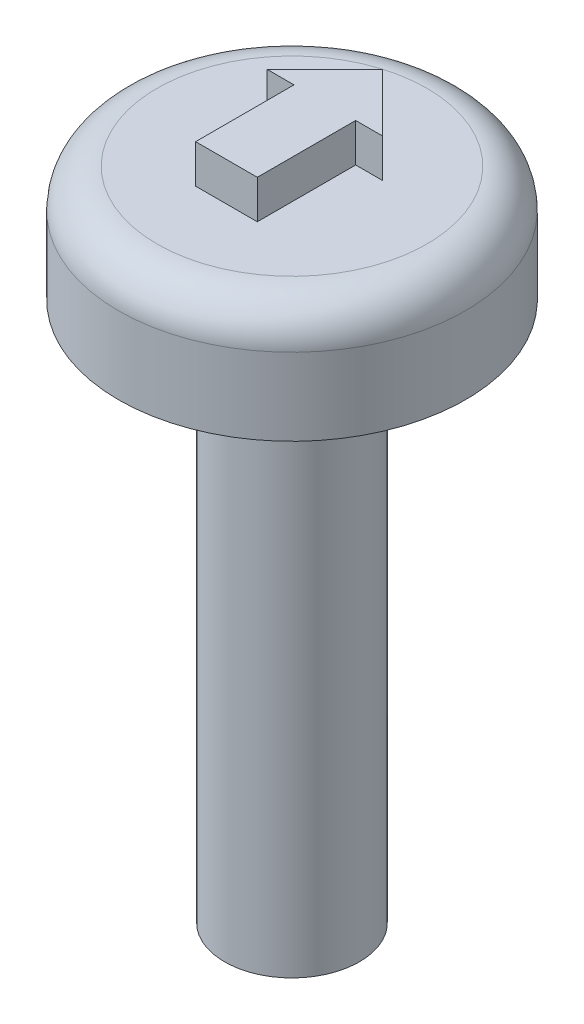
ISO-10303-21;
HEADER;
FILE_DESCRIPTION(('STEP AP214'),'2;1');
FILE_NAME('part.step','',(''),(''),'','','');
FILE_SCHEMA(('AUTOMOTIVE_DESIGN { 1 0 10303 214 1 1 1 1 }'));
ENDSEC;
DATA;
#1=APPLICATION_CONTEXT('core data for automotive mechanical design processes');
#2=APPLICATION_PROTOCOL_DEFINITION('international standard','automotive_design',2000,#1);
#3=PRODUCT_CONTEXT('',#1,'mechanical');
#4=PRODUCT('Part','Part','',(#3));
#5=PRODUCT_RELATED_PRODUCT_CATEGORY('part','',(#4));
#6=PRODUCT_DEFINITION_FORMATION('','',#4);
#7=PRODUCT_DEFINITION_CONTEXT('part definition',#1,'design');
#8=PRODUCT_DEFINITION('design','',#6,#7);
#9=PRODUCT_DEFINITION_SHAPE('','',#8);
#10=(LENGTH_UNIT() NAMED_UNIT(*) SI_UNIT(.MILLI.,.METRE.));
#11=(NAMED_UNIT(*) PLANE_ANGLE_UNIT() SI_UNIT($,.RADIAN.));
#12=(NAMED_UNIT(*) SI_UNIT($,.STERADIAN.) SOLID_ANGLE_UNIT());
#13=UNCERTAINTY_MEASURE_WITH_UNIT(LENGTH_MEASURE(1.E-05),#10,'distance_accuracy_value','');
#14=(GEOMETRIC_REPRESENTATION_CONTEXT(3) GLOBAL_UNCERTAINTY_ASSIGNED_CONTEXT((#13)) GLOBAL_UNIT_ASSIGNED_CONTEXT((#10,
#11,#12)) REPRESENTATION_CONTEXT('',''));
#15=CARTESIAN_POINT('',(0.,0.,0.));
#16=DIRECTION('',(0.,0.,1.));
#17=DIRECTION('',(1.,0.,0.));
#18=AXIS2_PLACEMENT_3D('',#15,#16,#17);
#19=CARTESIAN_POINT('',(40.910304770079,118.601538020996,143.155146091223));
#20=DIRECTION('',(0.,0.999999999999999,-4.37113995792923E-08));
#21=DIRECTION('',(0.,4.37113995792923E-08,0.999999999999999));
#22=AXIS2_PLACEMENT_3D('',#19,#20,#21);
#23=PLANE('',#22);
#24=CARTESIAN_POINT('',(40.910304770079,118.601538020996,143.155146091223));
#25=DIRECTION('',(0.,0.999999999999999,-4.37113995792923E-08));
#26=DIRECTION('',(0.,4.37113995792923E-08,0.999999999999999));
#27=AXIS2_PLACEMENT_3D('',#24,#25,#26);
#28=CIRCLE('',#27,3.50000000000005);
#29=CARTESIAN_POINT('',(40.910304770079,118.601538173986,146.655146091223));
#30=VERTEX_POINT('',#29);
#31=EDGE_CURVE('E153',#30,#30,#28,.T.);
#32=ORIENTED_EDGE('',*,*,#31,.T.);
#33=EDGE_LOOP('',(#32));
#34=FACE_BOUND('',#33,.T.);
#35=DIRECTION('',(0.,4.37113956441098E-08,0.999999999999999));
#36=VECTOR('',#35,1.);
#37=CARTESIAN_POINT('',(40.110304770079,118.60153798376,142.303283684095));
#38=LINE('',#37,#36);
#39=CARTESIAN_POINT('',(40.110304770079,118.60153798376,142.303283684095));
#40=VERTEX_POINT('',#39);
#41=CARTESIAN_POINT('',(40.110304770079,118.601538095305,144.855146091223));
#42=VERTEX_POINT('',#41);
#43=EDGE_CURVE('E128',#40,#42,#38,.T.);
#44=ORIENTED_EDGE('',*,*,#43,.F.);
#45=DIRECTION('',(1.,0.,0.));
#46=VECTOR('',#45,1.);
#47=CARTESIAN_POINT('',(39.410304770079,118.60153798376,142.303283684095));
#48=LINE('',#47,#46);
#49=CARTESIAN_POINT('',(39.410304770079,118.60153798376,142.303283684095));
#50=VERTEX_POINT('',#49);
#51=EDGE_CURVE('E125',#50,#40,#48,.T.);
#52=ORIENTED_EDGE('',*,*,#51,.F.);
#53=DIRECTION('',(-0.707106781186547,3.09086242539357E-08,0.707106781186547));
#54=VECTOR('',#53,1.);
#55=CARTESIAN_POINT('',(40.910304770079,118.601537918193,140.803283684095));
#56=LINE('',#55,#54);
#57=CARTESIAN_POINT('',(40.910304770079,118.601537918193,140.803283684095));
#58=VERTEX_POINT('',#57);
#59=EDGE_CURVE('E81',#58,#50,#56,.T.);
#60=ORIENTED_EDGE('',*,*,#59,.F.);
#61=DIRECTION('',(-0.707106781186546,-3.09086307959877E-08,-0.707106781186549));
#62=VECTOR('',#61,1.);
#63=CARTESIAN_POINT('',(42.410304770079,118.60153798376,142.303283684095));
#64=LINE('',#63,#62);
#65=CARTESIAN_POINT('',(42.410304770079,118.60153798376,142.303283684095));
#66=VERTEX_POINT('',#65);
#67=EDGE_CURVE('E136',#66,#58,#64,.T.);
#68=ORIENTED_EDGE('',*,*,#67,.F.);
#69=DIRECTION('',(1.,0.,0.));
#70=VECTOR('',#69,1.);
#71=CARTESIAN_POINT('',(41.710304770079,118.60153798376,142.303283684095));
#72=LINE('',#71,#70);
#73=CARTESIAN_POINT('',(41.710304770079,118.60153798376,142.303283684095));
#74=VERTEX_POINT('',#73);
#75=EDGE_CURVE('E114',#74,#66,#72,.T.);
#76=ORIENTED_EDGE('',*,*,#75,.F.);
#77=DIRECTION('',(0.,-4.37114010824076E-08,-0.999999999999999));
#78=VECTOR('',#77,1.);
#79=CARTESIAN_POINT('',(41.710304770079,118.601538095305,144.855146091223));
#80=LINE('',#79,#78);
#81=CARTESIAN_POINT('',(41.710304770079,118.601538095305,144.855146091223));
#82=VERTEX_POINT('',#81);
#83=EDGE_CURVE('E133',#82,#74,#80,.T.);
#84=ORIENTED_EDGE('',*,*,#83,.F.);
#85=DIRECTION('',(1.,0.,0.));
#86=VECTOR('',#85,1.);
#87=CARTESIAN_POINT('',(40.110304770079,118.601538095305,144.855146091223));
#88=LINE('',#87,#86);
#89=EDGE_CURVE('E131',#42,#82,#88,.T.);
#90=ORIENTED_EDGE('',*,*,#89,.F.);
#91=EDGE_LOOP('',(#44,#52,#60,#68,#76,#84,#90));
#92=FACE_BOUND('',#91,.T.);
#93=ADVANCED_FACE('F34',(#34,#92),#23,.T.);
#94=CARTESIAN_POINT('',(40.910304770079,118.601538020996,143.155146091223));
#95=DIRECTION('',(0.,-0.999999999999999,4.37113995792923E-08));
#96=DIRECTION('',(0.,-4.37113995792923E-08,-0.999999999999999));
#97=AXIS2_PLACEMENT_3D('',#94,#95,#96);
#98=CYLINDRICAL_SURFACE('',#97,4.50000000000005);
#99=CARTESIAN_POINT('',(40.910304770079,117.601538020996,143.155146134934));
#100=DIRECTION('',(0.,0.999999999999999,-4.37113995792923E-08));
#101=DIRECTION('',(0.,4.37113995792923E-08,0.999999999999999));
#102=AXIS2_PLACEMENT_3D('',#99,#100,#101);
#103=CIRCLE('',#102,4.50000000000005);
#104=CARTESIAN_POINT('',(40.910304770079,117.601538217697,147.655146134934));
#105=VERTEX_POINT('',#104);
#106=EDGE_CURVE('E38',#105,#105,#103,.F.);
#107=ORIENTED_EDGE('',*,*,#106,.T.);
#108=EDGE_LOOP('',(#107));
#109=FACE_BOUND('',#108,.T.);
#110=CARTESIAN_POINT('',(40.910304770079,115.601538020996,143.155146222357));
#111=DIRECTION('',(0.,0.999999999999999,-4.37113995792923E-08));
#112=DIRECTION('',(0.,4.37113995792923E-08,0.999999999999999));
#113=AXIS2_PLACEMENT_3D('',#110,#111,#112);
#114=CIRCLE('',#113,4.50000000000005);
#115=CARTESIAN_POINT('',(40.910304770079,115.601538217697,147.655146222357));
#116=VERTEX_POINT('',#115);
#117=EDGE_CURVE('E151',#116,#116,#114,.T.);
#118=ORIENTED_EDGE('',*,*,#117,.T.);
#119=EDGE_LOOP('',(#118));
#120=FACE_BOUND('',#119,.T.);
#121=ADVANCED_FACE('F160',(#109,#120),#98,.T.);
#122=CARTESIAN_POINT('',(40.910304770079,115.601538020996,143.155146222357));
#123=DIRECTION('',(0.,0.999999999999999,-4.37113995792923E-08));
#124=DIRECTION('',(0.,4.37113995792923E-08,0.999999999999999));
#125=AXIS2_PLACEMENT_3D('',#122,#123,#124);
#126=PLANE('',#125);
#127=CARTESIAN_POINT('',(40.910304770079,115.601538020996,143.155146222357));
#128=DIRECTION('',(0.,-0.999999999999999,4.37113995792923E-08));
#129=DIRECTION('',(0.,-4.37113995792923E-08,-0.999999999999999));
#130=AXIS2_PLACEMENT_3D('',#127,#128,#129);
#131=CIRCLE('',#130,1.75);
#132=CARTESIAN_POINT('',(40.910304770079,115.601537944501,141.405146222357));
#133=VERTEX_POINT('',#132);
#134=EDGE_CURVE('E11',#133,#133,#131,.T.);
#135=ORIENTED_EDGE('',*,*,#134,.F.);
#136=EDGE_LOOP('',(#135));
#137=FACE_BOUND('',#136,.T.);
#138=ORIENTED_EDGE('',*,*,#117,.F.);
#139=EDGE_LOOP('',(#138));
#140=FACE_BOUND('',#139,.T.);
#141=ADVANCED_FACE('F166',(#137,#140),#126,.F.);
#142=CARTESIAN_POINT('',(40.910304770079,117.601538020996,143.155146134934));
#143=DIRECTION('',(0.,0.999999999999999,-4.37113995792923E-08));
#144=DIRECTION('',(0.,4.37113995792923E-08,0.999999999999999));
#145=AXIS2_PLACEMENT_3D('',#142,#143,#144);
#146=TOROIDAL_SURFACE('',#145,3.50000000000005,1.);
#147=ORIENTED_EDGE('',*,*,#106,.F.);
#148=EDGE_LOOP('',(#147));
#149=FACE_BOUND('',#148,.T.);
#150=ORIENTED_EDGE('',*,*,#31,.F.);
#151=EDGE_LOOP('',(#150));
#152=FACE_BOUND('',#151,.T.);
#153=ADVANCED_FACE('F36',(#149,#152),#146,.T.);
#154=CARTESIAN_POINT('',(39.410304770079,119.60153798376,142.303283640384));
#155=DIRECTION('',(0.,-4.37113995792923E-08,-0.999999999999999));
#156=DIRECTION('',(0.,0.999999999999999,-4.37113995792923E-08));
#157=AXIS2_PLACEMENT_3D('',#154,#155,#156);
#158=PLANE('',#157);
#159=ORIENTED_EDGE('',*,*,#51,.T.);
#160=DIRECTION('',(0.,-0.999999999999999,4.37113995792923E-08));
#161=VECTOR('',#160,1.);
#162=CARTESIAN_POINT('',(40.110304770079,119.60153798376,142.303283640384));
#163=LINE('',#162,#161);
#164=CARTESIAN_POINT('',(40.110304770079,119.60153798376,142.303283640384));
#165=VERTEX_POINT('',#164);
#166=EDGE_CURVE('E149',#165,#40,#163,.T.);
#167=ORIENTED_EDGE('',*,*,#166,.F.);
#168=DIRECTION('',(1.,0.,0.));
#169=VECTOR('',#168,1.);
#170=CARTESIAN_POINT('',(39.410304770079,119.60153798376,142.303283640384));
#171=LINE('',#170,#169);
#172=CARTESIAN_POINT('',(39.410304770079,119.60153798376,142.303283640384));
#173=VERTEX_POINT('',#172);
#174=EDGE_CURVE('E139',#173,#165,#171,.T.);
#175=ORIENTED_EDGE('',*,*,#174,.F.);
#176=DIRECTION('',(0.,-0.999999999999999,4.37113995792923E-08));
#177=VECTOR('',#176,1.);
#178=CARTESIAN_POINT('',(39.410304770079,119.60153798376,142.303283640384));
#179=LINE('',#178,#177);
#180=EDGE_CURVE('E121',#173,#50,#179,.T.);
#181=ORIENTED_EDGE('',*,*,#180,.T.);
#182=EDGE_LOOP('',(#159,#167,#175,#181));
#183=FACE_BOUND('',#182,.T.);
#184=ADVANCED_FACE('F165',(#183),#158,.F.);
#185=CARTESIAN_POINT('',(40.110304770079,119.60153798376,142.303283640384));
#186=DIRECTION('',(1.,0.,0.));
#187=DIRECTION('',(0.,1.,0.));
#188=AXIS2_PLACEMENT_3D('',#185,#186,#187);
#189=PLANE('',#188);
#190=ORIENTED_EDGE('',*,*,#43,.T.);
#191=DIRECTION('',(0.,-0.999999999999999,4.37113995792923E-08));
#192=VECTOR('',#191,1.);
#193=CARTESIAN_POINT('',(40.110304770079,119.601538095305,144.855146047511));
#194=LINE('',#193,#192);
#195=CARTESIAN_POINT('',(40.110304770079,119.601538095305,144.855146047511));
#196=VERTEX_POINT('',#195);
#197=EDGE_CURVE('E146',#196,#42,#194,.T.);
#198=ORIENTED_EDGE('',*,*,#197,.F.);
#199=DIRECTION('',(0.,4.37113956441098E-08,0.999999999999999));
#200=VECTOR('',#199,1.);
#201=CARTESIAN_POINT('',(40.110304770079,119.60153798376,142.303283640384));
#202=LINE('',#201,#200);
#203=EDGE_CURVE('E89',#165,#196,#202,.T.);
#204=ORIENTED_EDGE('',*,*,#203,.F.);
#205=ORIENTED_EDGE('',*,*,#166,.T.);
#206=EDGE_LOOP('',(#190,#198,#204,#205));
#207=FACE_BOUND('',#206,.T.);
#208=ADVANCED_FACE('F171',(#207),#189,.F.);
#209=CARTESIAN_POINT('',(40.110304770079,119.601538095305,144.855146047511));
#210=DIRECTION('',(0.,-4.37113995792923E-08,-0.999999999999999));
#211=DIRECTION('',(0.,0.999999999999999,-4.37113995792923E-08));
#212=AXIS2_PLACEMENT_3D('',#209,#210,#211);
#213=PLANE('',#212);
#214=ORIENTED_EDGE('',*,*,#89,.T.);
#215=DIRECTION('',(0.,-0.999999999999999,4.37113995792923E-08));
#216=VECTOR('',#215,1.);
#217=CARTESIAN_POINT('',(41.710304770079,119.601538095305,144.855146047511));
#218=LINE('',#217,#216);
#219=CARTESIAN_POINT('',(41.710304770079,119.601538095305,144.855146047511));
#220=VERTEX_POINT('',#219);
#221=EDGE_CURVE('E143',#220,#82,#218,.T.);
#222=ORIENTED_EDGE('',*,*,#221,.F.);
#223=DIRECTION('',(1.,0.,0.));
#224=VECTOR('',#223,1.);
#225=CARTESIAN_POINT('',(40.110304770079,119.601538095305,144.855146047511));
#226=LINE('',#225,#224);
#227=EDGE_CURVE('E217',#196,#220,#226,.T.);
#228=ORIENTED_EDGE('',*,*,#227,.F.);
#229=ORIENTED_EDGE('',*,*,#197,.T.);
#230=EDGE_LOOP('',(#214,#222,#228,#229));
#231=FACE_BOUND('',#230,.T.);
#232=ADVANCED_FACE('F185',(#231),#213,.F.);
#233=CARTESIAN_POINT('',(41.710304770079,119.601538095305,144.855146047511));
#234=DIRECTION('',(-1.,0.,0.));
#235=DIRECTION('',(0.,-1.,0.));
#236=AXIS2_PLACEMENT_3D('',#233,#234,#235);
#237=PLANE('',#236);
#238=ORIENTED_EDGE('',*,*,#83,.T.);
#239=DIRECTION('',(0.,-0.999999999999999,4.37113995792923E-08));
#240=VECTOR('',#239,1.);
#241=CARTESIAN_POINT('',(41.710304770079,119.60153798376,142.303283640384));
#242=LINE('',#241,#240);
#243=CARTESIAN_POINT('',(41.710304770079,119.60153798376,142.303283640384));
#244=VERTEX_POINT('',#243);
#245=EDGE_CURVE('E117',#244,#74,#242,.T.);
#246=ORIENTED_EDGE('',*,*,#245,.F.);
#247=DIRECTION('',(0.,-4.37114010824076E-08,-0.999999999999999));
#248=VECTOR('',#247,1.);
#249=CARTESIAN_POINT('',(41.710304770079,119.601538095305,144.855146047511));
#250=LINE('',#249,#248);
#251=EDGE_CURVE('E105',#220,#244,#250,.T.);
#252=ORIENTED_EDGE('',*,*,#251,.F.);
#253=ORIENTED_EDGE('',*,*,#221,.T.);
#254=EDGE_LOOP('',(#238,#246,#252,#253));
#255=FACE_BOUND('',#254,.T.);
#256=ADVANCED_FACE('F188',(#255),#237,.F.);
#257=CARTESIAN_POINT('',(41.710304770079,119.60153798376,142.303283640384));
#258=DIRECTION('',(0.,-4.37113995792923E-08,-0.999999999999999));
#259=DIRECTION('',(0.,0.999999999999999,-4.37113995792923E-08));
#260=AXIS2_PLACEMENT_3D('',#257,#258,#259);
#261=PLANE('',#260);
#262=ORIENTED_EDGE('',*,*,#75,.T.);
#263=DIRECTION('',(0.,-0.999999999999999,4.37113995792923E-08));
#264=VECTOR('',#263,1.);
#265=CARTESIAN_POINT('',(42.410304770079,119.60153798376,142.303283640384));
#266=LINE('',#265,#264);
#267=CARTESIAN_POINT('',(42.410304770079,119.60153798376,142.303283640384));
#268=VERTEX_POINT('',#267);
#269=EDGE_CURVE('E111',#268,#66,#266,.T.);
#270=ORIENTED_EDGE('',*,*,#269,.F.);
#271=DIRECTION('',(1.,0.,0.));
#272=VECTOR('',#271,1.);
#273=CARTESIAN_POINT('',(41.710304770079,119.60153798376,142.303283640384));
#274=LINE('',#273,#272);
#275=EDGE_CURVE('E99',#244,#268,#274,.T.);
#276=ORIENTED_EDGE('',*,*,#275,.F.);
#277=ORIENTED_EDGE('',*,*,#245,.T.);
#278=EDGE_LOOP('',(#262,#270,#276,#277));
#279=FACE_BOUND('',#278,.T.);
#280=ADVANCED_FACE('F112',(#279),#261,.F.);
#281=CARTESIAN_POINT('',(42.410304770079,119.60153798376,142.303283640384));
#282=DIRECTION('',(-0.707106781186549,3.09086242539358E-08,0.707106781186545));
#283=DIRECTION('',(0.707106781186545,0.,0.70710678118655));
#284=AXIS2_PLACEMENT_3D('',#281,#282,#283);
#285=PLANE('',#284);
#286=ORIENTED_EDGE('',*,*,#67,.T.);
#287=DIRECTION('',(0.,-0.999999999999999,4.37113995792923E-08));
#288=VECTOR('',#287,1.);
#289=CARTESIAN_POINT('',(40.910304770079,119.601537918193,140.803283640384));
#290=LINE('',#289,#288);
#291=CARTESIAN_POINT('',(40.910304770079,119.601537918193,140.803283640384));
#292=VERTEX_POINT('',#291);
#293=EDGE_CURVE('E50',#292,#58,#290,.T.);
#294=ORIENTED_EDGE('',*,*,#293,.F.);
#295=DIRECTION('',(-0.707106781186546,-3.09086307959877E-08,-0.707106781186549));
#296=VECTOR('',#295,1.);
#297=CARTESIAN_POINT('',(42.410304770079,119.60153798376,142.303283640384));
#298=LINE('',#297,#296);
#299=EDGE_CURVE('E103',#268,#292,#298,.T.);
#300=ORIENTED_EDGE('',*,*,#299,.F.);
#301=ORIENTED_EDGE('',*,*,#269,.T.);
#302=EDGE_LOOP('',(#286,#294,#300,#301));
#303=FACE_BOUND('',#302,.T.);
#304=ADVANCED_FACE('F119',(#303),#285,.F.);
#305=CARTESIAN_POINT('',(40.910304770079,119.601537918193,140.803283640384));
#306=DIRECTION('',(0.707106781186548,3.09086298614089E-08,0.707106781186547));
#307=DIRECTION('',(0.707106781186547,0.,-0.707106781186548));
#308=AXIS2_PLACEMENT_3D('',#305,#306,#307);
#309=PLANE('',#308);
#310=ORIENTED_EDGE('',*,*,#59,.T.);
#311=ORIENTED_EDGE('',*,*,#180,.F.);
#312=DIRECTION('',(-0.707106781186547,3.09086242539357E-08,0.707106781186547));
#313=VECTOR('',#312,1.);
#314=CARTESIAN_POINT('',(40.910304770079,119.601537918193,140.803283640384));
#315=LINE('',#314,#313);
#316=EDGE_CURVE('E58',#292,#173,#315,.T.);
#317=ORIENTED_EDGE('',*,*,#316,.F.);
#318=ORIENTED_EDGE('',*,*,#293,.T.);
#319=EDGE_LOOP('',(#310,#311,#317,#318));
#320=FACE_BOUND('',#319,.T.);
#321=ADVANCED_FACE('F197',(#320),#309,.F.);
#322=CARTESIAN_POINT('',(-2.35528921293829E-12,119.601531763484,-5.22794987849039E-06));
#323=DIRECTION('',(0.,-0.999999999999999,4.37113956441098E-08));
#324=DIRECTION('',(0.,-4.37113956441098E-08,-0.999999999999999));
#325=AXIS2_PLACEMENT_3D('',#322,#323,#324);
#326=PLANE('',#325);
#327=ORIENTED_EDGE('',*,*,#174,.T.);
#328=ORIENTED_EDGE('',*,*,#203,.T.);
#329=ORIENTED_EDGE('',*,*,#227,.T.);
#330=ORIENTED_EDGE('',*,*,#251,.T.);
#331=ORIENTED_EDGE('',*,*,#275,.T.);
#332=ORIENTED_EDGE('',*,*,#299,.T.);
#333=ORIENTED_EDGE('',*,*,#316,.T.);
#334=EDGE_LOOP('',(#327,#328,#329,#330,#331,#332,#333));
#335=FACE_BOUND('',#334,.T.);
#336=ADVANCED_FACE('F101',(#335),#326,.F.);
#337=CARTESIAN_POINT('',(40.9103047700791,101.601538020996,143.155146834317));
#338=DIRECTION('',(0.,0.999999999999999,-4.37113995792923E-08));
#339=DIRECTION('',(0.,4.37113995792923E-08,0.999999999999999));
#340=AXIS2_PLACEMENT_3D('',#337,#338,#339);
#341=CYLINDRICAL_SURFACE('',#340,1.75);
#342=CARTESIAN_POINT('',(40.9103047700791,101.601538020996,143.155146834317));
#343=DIRECTION('',(0.,-0.999999999999999,4.37113995792923E-08));
#344=DIRECTION('',(0.,-4.37113995792923E-08,-0.999999999999999));
#345=AXIS2_PLACEMENT_3D('',#342,#343,#344);
#346=CIRCLE('',#345,1.75);
#347=CARTESIAN_POINT('',(40.9103047700791,101.601537944501,141.405146834317));
#348=VERTEX_POINT('',#347);
#349=EDGE_CURVE('E129',#348,#348,#346,.T.);
#350=ORIENTED_EDGE('',*,*,#349,.F.);
#351=EDGE_LOOP('',(#350));
#352=FACE_BOUND('',#351,.T.);
#353=ORIENTED_EDGE('',*,*,#134,.T.);
#354=EDGE_LOOP('',(#353));
#355=FACE_BOUND('',#354,.T.);
#356=ADVANCED_FACE('F202',(#352,#355),#341,.T.);
#357=CARTESIAN_POINT('',(40.9103047700791,101.601538020996,143.155146834317));
#358=DIRECTION('',(0.,-0.999999999999999,4.37113995792923E-08));
#359=DIRECTION('',(0.,-4.37113995792923E-08,-0.999999999999999));
#360=AXIS2_PLACEMENT_3D('',#357,#358,#359);
#361=PLANE('',#360);
#362=ORIENTED_EDGE('',*,*,#349,.T.);
#363=EDGE_LOOP('',(#362));
#364=FACE_BOUND('',#363,.T.);
#365=ADVANCED_FACE('F205',(#364),#361,.T.);
#366=CLOSED_SHELL('',(#93,#121,#141,#153,#184,#208,#232,#256,#280,#304,#321,#336,#356,#365));
#367=MANIFOLD_SOLID_BREP('B2',#366);
#368=ADVANCED_BREP_SHAPE_REPRESENTATION('',(#18,#367),#14);
#369=SHAPE_DEFINITION_REPRESENTATION(#9,#368);
ENDSEC;
END-ISO-10303-21;
